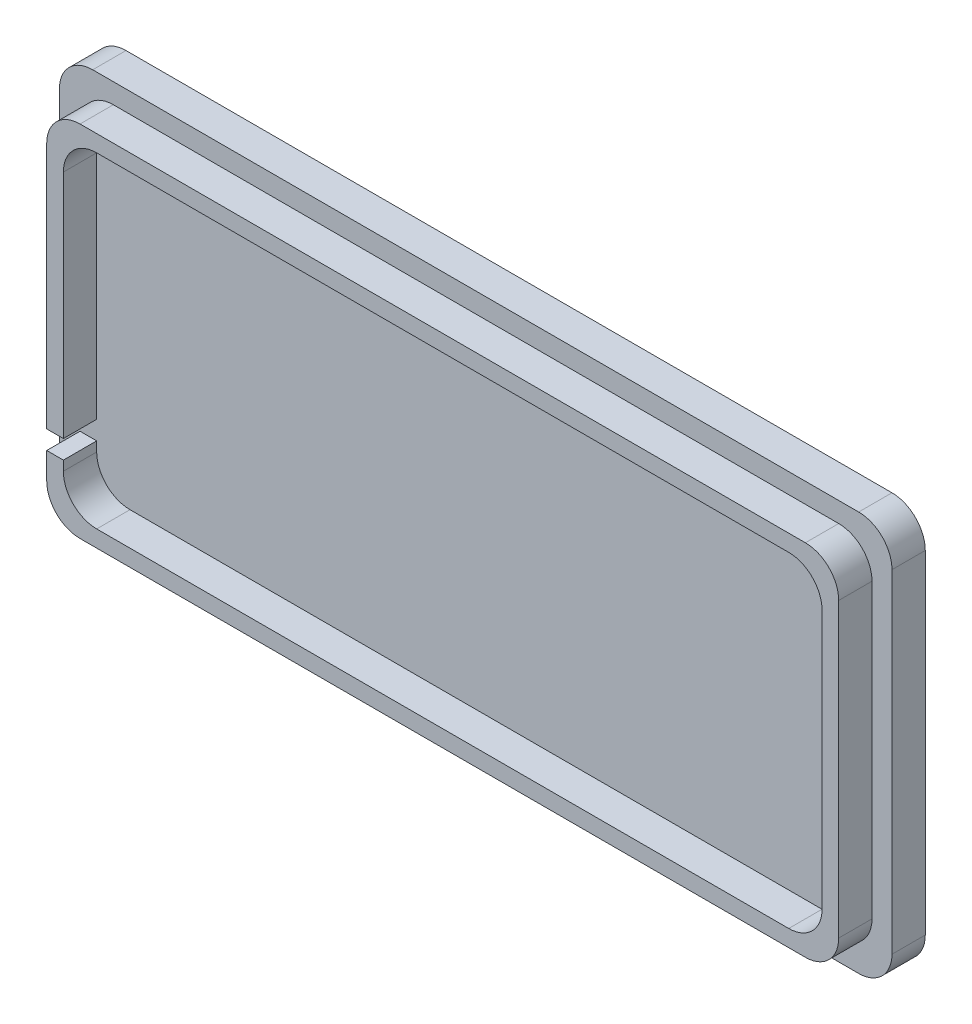
ISO-10303-21;
HEADER;
FILE_DESCRIPTION(('STEP AP214'),'2;1');
FILE_NAME('part.step','',(''),(''),'','','');
FILE_SCHEMA(('AUTOMOTIVE_DESIGN { 1 0 10303 214 1 1 1 1 }'));
ENDSEC;
DATA;
#1=APPLICATION_CONTEXT('core data for automotive mechanical design processes');
#2=APPLICATION_PROTOCOL_DEFINITION('international standard','automotive_design',2000,#1);
#3=PRODUCT_CONTEXT('',#1,'mechanical');
#4=PRODUCT('Part','Part','',(#3));
#5=PRODUCT_RELATED_PRODUCT_CATEGORY('part','',(#4));
#6=PRODUCT_DEFINITION_FORMATION('','',#4);
#7=PRODUCT_DEFINITION_CONTEXT('part definition',#1,'design');
#8=PRODUCT_DEFINITION('design','',#6,#7);
#9=PRODUCT_DEFINITION_SHAPE('','',#8);
#10=(LENGTH_UNIT() NAMED_UNIT(*) SI_UNIT(.MILLI.,.METRE.));
#11=(NAMED_UNIT(*) PLANE_ANGLE_UNIT() SI_UNIT($,.RADIAN.));
#12=(NAMED_UNIT(*) SI_UNIT($,.STERADIAN.) SOLID_ANGLE_UNIT());
#13=UNCERTAINTY_MEASURE_WITH_UNIT(LENGTH_MEASURE(1.E-05),#10,'distance_accuracy_value','');
#14=(GEOMETRIC_REPRESENTATION_CONTEXT(3) GLOBAL_UNCERTAINTY_ASSIGNED_CONTEXT((#13)) GLOBAL_UNIT_ASSIGNED_CONTEXT((#10,
#11,#12)) REPRESENTATION_CONTEXT('',''));
#15=CARTESIAN_POINT('',(0.,0.,0.));
#16=DIRECTION('',(0.,0.,1.));
#17=DIRECTION('',(1.,0.,0.));
#18=AXIS2_PLACEMENT_3D('',#15,#16,#17);
#19=CARTESIAN_POINT('',(-151.003,68.453,12.7));
#20=DIRECTION('',(1.,0.,0.));
#21=DIRECTION('',(0.,0.,-1.));
#22=AXIS2_PLACEMENT_3D('',#19,#20,#21);
#23=PLANE('',#22);
#24=DIRECTION('',(0.,-1.,0.));
#25=VECTOR('',#24,1.);
#26=CARTESIAN_POINT('',(-151.003,68.453,12.7));
#27=LINE('',#26,#25);
#28=CARTESIAN_POINT('',(-151.003,55.753,12.7));
#29=VERTEX_POINT('',#28);
#30=CARTESIAN_POINT('',(-151.003,-38.6080000000006,12.7));
#31=VERTEX_POINT('',#30);
#32=EDGE_CURVE('E247',#29,#31,#27,.T.);
#33=ORIENTED_EDGE('',*,*,#32,.F.);
#34=DIRECTION('',(0.,0.,-1.));
#35=VECTOR('',#34,1.);
#36=CARTESIAN_POINT('',(-151.003,55.753,12.7));
#37=LINE('',#36,#35);
#38=CARTESIAN_POINT('',(-151.003,55.753,0.));
#39=VERTEX_POINT('',#38);
#40=EDGE_CURVE('E358',#29,#39,#37,.T.);
#41=ORIENTED_EDGE('',*,*,#40,.T.);
#42=DIRECTION('',(0.,-1.,0.));
#43=VECTOR('',#42,1.);
#44=CARTESIAN_POINT('',(-151.003,68.453,0.));
#45=LINE('',#44,#43);
#46=CARTESIAN_POINT('',(-151.003,-38.6080000000006,0.));
#47=VERTEX_POINT('',#46);
#48=EDGE_CURVE('E314',#39,#47,#45,.T.);
#49=ORIENTED_EDGE('',*,*,#48,.T.);
#50=DIRECTION('',(0.,0.,-1.));
#51=VECTOR('',#50,1.);
#52=CARTESIAN_POINT('',(-151.003,-38.6080000000006,12.7));
#53=LINE('',#52,#51);
#54=EDGE_CURVE('E256',#31,#47,#53,.T.);
#55=ORIENTED_EDGE('',*,*,#54,.F.);
#56=EDGE_LOOP('',(#33,#41,#49,#55));
#57=FACE_BOUND('',#56,.T.);
#58=ADVANCED_FACE('F33',(#57),#23,.F.);
#59=CARTESIAN_POINT('',(-144.653,62.103,0.));
#60=DIRECTION('',(-1.,0.,0.));
#61=DIRECTION('',(0.,0.,1.));
#62=AXIS2_PLACEMENT_3D('',#59,#60,#61);
#63=PLANE('',#62);
#64=DIRECTION('',(0.,-1.,0.));
#65=VECTOR('',#64,1.);
#66=CARTESIAN_POINT('',(-144.653,62.103,0.));
#67=LINE('',#66,#65);
#68=CARTESIAN_POINT('',(-144.653,49.403,0.));
#69=VERTEX_POINT('',#68);
#70=CARTESIAN_POINT('',(-144.653,-38.6080000000006,0.));
#71=VERTEX_POINT('',#70);
#72=EDGE_CURVE('E267',#69,#71,#67,.T.);
#73=ORIENTED_EDGE('',*,*,#72,.F.);
#74=DIRECTION('',(0.,0.,1.));
#75=VECTOR('',#74,1.);
#76=CARTESIAN_POINT('',(-144.653,49.403,12.7));
#77=LINE('',#76,#75);
#78=CARTESIAN_POINT('',(-144.653,49.403,12.7));
#79=VERTEX_POINT('',#78);
#80=EDGE_CURVE('E226',#69,#79,#77,.T.);
#81=ORIENTED_EDGE('',*,*,#80,.T.);
#82=DIRECTION('',(0.,-1.,0.));
#83=VECTOR('',#82,1.);
#84=CARTESIAN_POINT('',(-144.653,62.103,12.7));
#85=LINE('',#84,#83);
#86=CARTESIAN_POINT('',(-144.653,-38.6080000000006,12.7));
#87=VERTEX_POINT('',#86);
#88=EDGE_CURVE('E220',#79,#87,#85,.T.);
#89=ORIENTED_EDGE('',*,*,#88,.T.);
#90=DIRECTION('',(0.,0.,1.));
#91=VECTOR('',#90,1.);
#92=CARTESIAN_POINT('',(-144.653,-38.6080000000006,12.7));
#93=LINE('',#92,#91);
#94=EDGE_CURVE('E224',#71,#87,#93,.T.);
#95=ORIENTED_EDGE('',*,*,#94,.F.);
#96=EDGE_LOOP('',(#73,#81,#89,#95));
#97=FACE_BOUND('',#96,.T.);
#98=ADVANCED_FACE('F223',(#97),#63,.F.);
#99=CARTESIAN_POINT('',(-151.003,-45.7200000000006,0.));
#100=VERTEX_POINT('',#99);
#101=CARTESIAN_POINT('',(-151.003,-55.753,0.));
#102=VERTEX_POINT('',#101);
#103=EDGE_CURVE('E293',#100,#102,#45,.T.);
#104=ORIENTED_EDGE('',*,*,#103,.T.);
#105=DIRECTION('',(0.,0.,-1.));
#106=VECTOR('',#105,1.);
#107=CARTESIAN_POINT('',(-151.003,-55.753,12.7));
#108=LINE('',#107,#106);
#109=CARTESIAN_POINT('',(-151.003,-55.753,12.7));
#110=VERTEX_POINT('',#109);
#111=EDGE_CURVE('E384',#102,#110,#108,.F.);
#112=ORIENTED_EDGE('',*,*,#111,.T.);
#113=CARTESIAN_POINT('',(-151.003,-45.7200000000006,12.7));
#114=VERTEX_POINT('',#113);
#115=EDGE_CURVE('E305',#114,#110,#27,.T.);
#116=ORIENTED_EDGE('',*,*,#115,.F.);
#117=DIRECTION('',(0.,0.,1.));
#118=VECTOR('',#117,1.);
#119=CARTESIAN_POINT('',(-151.003,-45.7200000000006,12.7));
#120=LINE('',#119,#118);
#121=EDGE_CURVE('E258',#100,#114,#120,.T.);
#122=ORIENTED_EDGE('',*,*,#121,.F.);
#123=EDGE_LOOP('',(#104,#112,#116,#122));
#124=FACE_BOUND('',#123,.T.);
#125=ADVANCED_FACE('F502',(#124),#23,.F.);
#126=CARTESIAN_POINT('',(-151.003,-68.453,12.7));
#127=DIRECTION('',(0.,1.,0.));
#128=DIRECTION('',(-1.,0.,0.));
#129=AXIS2_PLACEMENT_3D('',#126,#127,#128);
#130=PLANE('',#129);
#131=DIRECTION('',(1.,0.,0.));
#132=VECTOR('',#131,1.);
#133=CARTESIAN_POINT('',(-151.003,-68.453,0.));
#134=LINE('',#133,#132);
#135=CARTESIAN_POINT('',(-138.303,-68.453,0.));
#136=VERTEX_POINT('',#135);
#137=CARTESIAN_POINT('',(138.303,-68.453,0.));
#138=VERTEX_POINT('',#137);
#139=EDGE_CURVE('E316',#136,#138,#134,.T.);
#140=ORIENTED_EDGE('',*,*,#139,.T.);
#141=DIRECTION('',(0.,0.,-1.));
#142=VECTOR('',#141,1.);
#143=CARTESIAN_POINT('',(138.303,-68.453,12.7));
#144=LINE('',#143,#142);
#145=CARTESIAN_POINT('',(138.303,-68.453,12.7));
#146=VERTEX_POINT('',#145);
#147=EDGE_CURVE('E382',#138,#146,#144,.F.);
#148=ORIENTED_EDGE('',*,*,#147,.T.);
#149=DIRECTION('',(1.,0.,0.));
#150=VECTOR('',#149,1.);
#151=CARTESIAN_POINT('',(-151.003,-68.453,12.7));
#152=LINE('',#151,#150);
#153=CARTESIAN_POINT('',(-138.303,-68.453,12.7));
#154=VERTEX_POINT('',#153);
#155=EDGE_CURVE('E304',#154,#146,#152,.T.);
#156=ORIENTED_EDGE('',*,*,#155,.F.);
#157=DIRECTION('',(0.,0.,-1.));
#158=VECTOR('',#157,1.);
#159=CARTESIAN_POINT('',(-138.303,-68.453,12.7));
#160=LINE('',#159,#158);
#161=EDGE_CURVE('E379',#154,#136,#160,.T.);
#162=ORIENTED_EDGE('',*,*,#161,.T.);
#163=EDGE_LOOP('',(#140,#148,#156,#162));
#164=FACE_BOUND('',#163,.T.);
#165=ADVANCED_FACE('F432',(#164),#130,.F.);
#166=CARTESIAN_POINT('',(151.003,68.453,12.7));
#167=DIRECTION('',(-1.,0.,0.));
#168=DIRECTION('',(0.,0.,1.));
#169=AXIS2_PLACEMENT_3D('',#166,#167,#168);
#170=PLANE('',#169);
#171=DIRECTION('',(0.,1.,0.));
#172=VECTOR('',#171,1.);
#173=CARTESIAN_POINT('',(151.003,68.453,0.));
#174=LINE('',#173,#172);
#175=CARTESIAN_POINT('',(151.003,-55.753,0.));
#176=VERTEX_POINT('',#175);
#177=CARTESIAN_POINT('',(151.003,55.753,0.));
#178=VERTEX_POINT('',#177);
#179=EDGE_CURVE('E319',#176,#178,#174,.T.);
#180=ORIENTED_EDGE('',*,*,#179,.T.);
#181=DIRECTION('',(0.,0.,-1.));
#182=VECTOR('',#181,1.);
#183=CARTESIAN_POINT('',(151.003,55.753,12.7));
#184=LINE('',#183,#182);
#185=CARTESIAN_POINT('',(151.003,55.753,12.7));
#186=VERTEX_POINT('',#185);
#187=EDGE_CURVE('E377',#178,#186,#184,.F.);
#188=ORIENTED_EDGE('',*,*,#187,.T.);
#189=DIRECTION('',(0.,1.,0.));
#190=VECTOR('',#189,1.);
#191=CARTESIAN_POINT('',(151.003,68.453,12.7));
#192=LINE('',#191,#190);
#193=CARTESIAN_POINT('',(151.003,-55.753,12.7));
#194=VERTEX_POINT('',#193);
#195=EDGE_CURVE('E308',#194,#186,#192,.T.);
#196=ORIENTED_EDGE('',*,*,#195,.F.);
#197=DIRECTION('',(0.,0.,-1.));
#198=VECTOR('',#197,1.);
#199=CARTESIAN_POINT('',(151.003,-55.753,12.7));
#200=LINE('',#199,#198);
#201=EDGE_CURVE('E374',#194,#176,#200,.T.);
#202=ORIENTED_EDGE('',*,*,#201,.T.);
#203=EDGE_LOOP('',(#180,#188,#196,#202));
#204=FACE_BOUND('',#203,.T.);
#205=ADVANCED_FACE('F440',(#204),#170,.F.);
#206=CARTESIAN_POINT('',(-151.003,68.453,12.7));
#207=DIRECTION('',(0.,-1.,0.));
#208=DIRECTION('',(1.,0.,0.));
#209=AXIS2_PLACEMENT_3D('',#206,#207,#208);
#210=PLANE('',#209);
#211=DIRECTION('',(-1.,0.,0.));
#212=VECTOR('',#211,1.);
#213=CARTESIAN_POINT('',(-151.003,68.453,0.));
#214=LINE('',#213,#212);
#215=CARTESIAN_POINT('',(138.303,68.453,0.));
#216=VERTEX_POINT('',#215);
#217=CARTESIAN_POINT('',(-138.303,68.453,0.));
#218=VERTEX_POINT('',#217);
#219=EDGE_CURVE('E322',#216,#218,#214,.T.);
#220=ORIENTED_EDGE('',*,*,#219,.T.);
#221=DIRECTION('',(0.,0.,-1.));
#222=VECTOR('',#221,1.);
#223=CARTESIAN_POINT('',(-138.303,68.453,12.7));
#224=LINE('',#223,#222);
#225=CARTESIAN_POINT('',(-138.303,68.453,12.7));
#226=VERTEX_POINT('',#225);
#227=EDGE_CURVE('E364',#218,#226,#224,.F.);
#228=ORIENTED_EDGE('',*,*,#227,.T.);
#229=DIRECTION('',(-1.,0.,0.));
#230=VECTOR('',#229,1.);
#231=CARTESIAN_POINT('',(-151.003,68.453,12.7));
#232=LINE('',#231,#230);
#233=CARTESIAN_POINT('',(138.303,68.453,12.7));
#234=VERTEX_POINT('',#233);
#235=EDGE_CURVE('E311',#234,#226,#232,.T.);
#236=ORIENTED_EDGE('',*,*,#235,.F.);
#237=DIRECTION('',(0.,0.,-1.));
#238=VECTOR('',#237,1.);
#239=CARTESIAN_POINT('',(138.303,68.453,12.7));
#240=LINE('',#239,#238);
#241=EDGE_CURVE('E361',#234,#216,#240,.T.);
#242=ORIENTED_EDGE('',*,*,#241,.T.);
#243=EDGE_LOOP('',(#220,#228,#236,#242));
#244=FACE_BOUND('',#243,.T.);
#245=ADVANCED_FACE('F448',(#244),#210,.F.);
#246=CARTESIAN_POINT('',(0.,0.,12.7));
#247=DIRECTION('',(0.,0.,1.));
#248=DIRECTION('',(1.,0.,0.));
#249=AXIS2_PLACEMENT_3D('',#246,#247,#248);
#250=PLANE('',#249);
#251=ORIENTED_EDGE('',*,*,#235,.T.);
#252=CARTESIAN_POINT('',(-138.303,55.753,12.7));
#253=DIRECTION('',(0.,0.,1.));
#254=DIRECTION('',(1.,0.,0.));
#255=AXIS2_PLACEMENT_3D('',#252,#253,#254);
#256=CIRCLE('',#255,12.7);
#257=EDGE_CURVE('E372',#226,#29,#256,.T.);
#258=ORIENTED_EDGE('',*,*,#257,.T.);
#259=ORIENTED_EDGE('',*,*,#32,.T.);
#260=DIRECTION('',(1.,0.,0.));
#261=VECTOR('',#260,1.);
#262=CARTESIAN_POINT('',(158.624,-38.6080000000006,12.7));
#263=LINE('',#262,#261);
#264=EDGE_CURVE('E237',#31,#87,#263,.T.);
#265=ORIENTED_EDGE('',*,*,#264,.T.);
#266=ORIENTED_EDGE('',*,*,#88,.F.);
#267=CARTESIAN_POINT('',(-131.953,49.403,12.7));
#268=DIRECTION('',(0.,0.,1.));
#269=DIRECTION('',(1.,0.,0.));
#270=AXIS2_PLACEMENT_3D('',#267,#268,#269);
#271=CIRCLE('',#270,12.7);
#272=CARTESIAN_POINT('',(-131.953,62.103,12.7));
#273=VERTEX_POINT('',#272);
#274=EDGE_CURVE('E418',#79,#273,#271,.F.);
#275=ORIENTED_EDGE('',*,*,#274,.T.);
#276=DIRECTION('',(-1.,0.,0.));
#277=VECTOR('',#276,1.);
#278=CARTESIAN_POINT('',(144.653,62.103,12.7));
#279=LINE('',#278,#277);
#280=CARTESIAN_POINT('',(131.953,62.103,12.7));
#281=VERTEX_POINT('',#280);
#282=EDGE_CURVE('E241',#281,#273,#279,.T.);
#283=ORIENTED_EDGE('',*,*,#282,.F.);
#284=CARTESIAN_POINT('',(131.953,49.403,12.7));
#285=DIRECTION('',(0.,0.,1.));
#286=DIRECTION('',(1.,0.,0.));
#287=AXIS2_PLACEMENT_3D('',#284,#285,#286);
#288=CIRCLE('',#287,12.7);
#289=CARTESIAN_POINT('',(144.653,49.403,12.7));
#290=VERTEX_POINT('',#289);
#291=EDGE_CURVE('E412',#281,#290,#288,.F.);
#292=ORIENTED_EDGE('',*,*,#291,.T.);
#293=DIRECTION('',(0.,1.,0.));
#294=VECTOR('',#293,1.);
#295=CARTESIAN_POINT('',(144.653,-62.103,12.7));
#296=LINE('',#295,#294);
#297=CARTESIAN_POINT('',(144.653,-49.403,12.7));
#298=VERTEX_POINT('',#297);
#299=EDGE_CURVE('E266',#298,#290,#296,.T.);
#300=ORIENTED_EDGE('',*,*,#299,.F.);
#301=CARTESIAN_POINT('',(131.953,-49.403,12.7));
#302=DIRECTION('',(0.,0.,1.));
#303=DIRECTION('',(1.,0.,0.));
#304=AXIS2_PLACEMENT_3D('',#301,#302,#303);
#305=CIRCLE('',#304,12.7);
#306=CARTESIAN_POINT('',(131.953,-62.103,12.7));
#307=VERTEX_POINT('',#306);
#308=EDGE_CURVE('E414',#298,#307,#305,.F.);
#309=ORIENTED_EDGE('',*,*,#308,.T.);
#310=DIRECTION('',(1.,0.,0.));
#311=VECTOR('',#310,1.);
#312=CARTESIAN_POINT('',(-144.653,-62.103,12.7));
#313=LINE('',#312,#311);
#314=CARTESIAN_POINT('',(-131.953,-62.103,12.7));
#315=VERTEX_POINT('',#314);
#316=EDGE_CURVE('E229',#315,#307,#313,.T.);
#317=ORIENTED_EDGE('',*,*,#316,.F.);
#318=CARTESIAN_POINT('',(-131.953,-49.403,12.7));
#319=DIRECTION('',(0.,0.,1.));
#320=DIRECTION('',(1.,0.,0.));
#321=AXIS2_PLACEMENT_3D('',#318,#319,#320);
#322=CIRCLE('',#321,12.7);
#323=CARTESIAN_POINT('',(-144.653,-49.403,12.7));
#324=VERTEX_POINT('',#323);
#325=EDGE_CURVE('E416',#315,#324,#322,.F.);
#326=ORIENTED_EDGE('',*,*,#325,.T.);
#327=CARTESIAN_POINT('',(-144.653,-45.7200000000006,12.7));
#328=VERTEX_POINT('',#327);
#329=EDGE_CURVE('E230',#328,#324,#85,.T.);
#330=ORIENTED_EDGE('',*,*,#329,.F.);
#331=DIRECTION('',(-1.,0.,0.));
#332=VECTOR('',#331,1.);
#333=CARTESIAN_POINT('',(158.624,-45.7200000000006,12.7));
#334=LINE('',#333,#332);
#335=EDGE_CURVE('E248',#328,#114,#334,.T.);
#336=ORIENTED_EDGE('',*,*,#335,.T.);
#337=ORIENTED_EDGE('',*,*,#115,.T.);
#338=CARTESIAN_POINT('',(-138.303,-55.753,12.7));
#339=DIRECTION('',(0.,0.,1.));
#340=DIRECTION('',(1.,0.,0.));
#341=AXIS2_PLACEMENT_3D('',#338,#339,#340);
#342=CIRCLE('',#341,12.7);
#343=EDGE_CURVE('E366',#110,#154,#342,.T.);
#344=ORIENTED_EDGE('',*,*,#343,.T.);
#345=ORIENTED_EDGE('',*,*,#155,.T.);
#346=CARTESIAN_POINT('',(138.303,-55.753,12.7));
#347=DIRECTION('',(0.,0.,1.));
#348=DIRECTION('',(1.,0.,0.));
#349=AXIS2_PLACEMENT_3D('',#346,#347,#348);
#350=CIRCLE('',#349,12.7);
#351=EDGE_CURVE('E368',#146,#194,#350,.T.);
#352=ORIENTED_EDGE('',*,*,#351,.T.);
#353=ORIENTED_EDGE('',*,*,#195,.T.);
#354=CARTESIAN_POINT('',(138.303,55.753,12.7));
#355=DIRECTION('',(0.,0.,1.));
#356=DIRECTION('',(1.,0.,0.));
#357=AXIS2_PLACEMENT_3D('',#354,#355,#356);
#358=CIRCLE('',#357,12.7);
#359=EDGE_CURVE('E370',#186,#234,#358,.T.);
#360=ORIENTED_EDGE('',*,*,#359,.T.);
#361=EDGE_LOOP('',(#251,#258,#259,#265,#266,#275,#283,#292,#300,#309,#317,#326,#330,#336,#337,
#344,#345,#352,#353,#360));
#362=FACE_BOUND('',#361,.T.);
#363=ADVANCED_FACE('F245',(#362),#250,.T.);
#364=CARTESIAN_POINT('',(-158.877,-76.327,-12.7));
#365=DIRECTION('',(1.,0.,0.));
#366=DIRECTION('',(0.,0.,-1.));
#367=AXIS2_PLACEMENT_3D('',#364,#365,#366);
#368=PLANE('',#367);
#369=DIRECTION('',(0.,1.,0.));
#370=VECTOR('',#369,1.);
#371=CARTESIAN_POINT('',(-158.877,-76.327,-12.7));
#372=LINE('',#371,#370);
#373=CARTESIAN_POINT('',(-158.877,-63.627,-12.7));
#374=VERTEX_POINT('',#373);
#375=CARTESIAN_POINT('',(-158.877,63.373,-12.7));
#376=VERTEX_POINT('',#375);
#377=EDGE_CURVE('E282',#374,#376,#372,.T.);
#378=ORIENTED_EDGE('',*,*,#377,.F.);
#379=DIRECTION('',(0.,0.,1.));
#380=VECTOR('',#379,1.);
#381=CARTESIAN_POINT('',(-158.877,-63.627,-12.7));
#382=LINE('',#381,#380);
#383=CARTESIAN_POINT('',(-158.877,-63.627,0.));
#384=VERTEX_POINT('',#383);
#385=EDGE_CURVE('E388',#374,#384,#382,.T.);
#386=ORIENTED_EDGE('',*,*,#385,.T.);
#387=DIRECTION('',(0.,1.,0.));
#388=VECTOR('',#387,1.);
#389=CARTESIAN_POINT('',(-158.877,-76.327,0.));
#390=LINE('',#389,#388);
#391=CARTESIAN_POINT('',(-158.877,63.373,0.));
#392=VERTEX_POINT('',#391);
#393=EDGE_CURVE('E275',#384,#392,#390,.T.);
#394=ORIENTED_EDGE('',*,*,#393,.T.);
#395=DIRECTION('',(0.,0.,1.));
#396=VECTOR('',#395,1.);
#397=CARTESIAN_POINT('',(-158.877,63.373,-12.7));
#398=LINE('',#397,#396);
#399=EDGE_CURVE('E386',#392,#376,#398,.F.);
#400=ORIENTED_EDGE('',*,*,#399,.T.);
#401=EDGE_LOOP('',(#378,#386,#394,#400));
#402=FACE_BOUND('',#401,.T.);
#403=ADVANCED_FACE('F539',(#402),#368,.F.);
#404=CARTESIAN_POINT('',(-158.877,76.073,-12.7));
#405=DIRECTION('',(0.,-1.,0.));
#406=DIRECTION('',(0.,0.,-1.));
#407=AXIS2_PLACEMENT_3D('',#404,#405,#406);
#408=PLANE('',#407);
#409=DIRECTION('',(1.,0.,0.));
#410=VECTOR('',#409,1.);
#411=CARTESIAN_POINT('',(-158.877,76.073,0.));
#412=LINE('',#411,#410);
#413=CARTESIAN_POINT('',(-146.177,76.073,0.));
#414=VERTEX_POINT('',#413);
#415=CARTESIAN_POINT('',(145.923,76.073,0.));
#416=VERTEX_POINT('',#415);
#417=EDGE_CURVE('E296',#414,#416,#412,.T.);
#418=ORIENTED_EDGE('',*,*,#417,.T.);
#419=DIRECTION('',(0.,0.,1.));
#420=VECTOR('',#419,1.);
#421=CARTESIAN_POINT('',(145.923,76.073,-12.7));
#422=LINE('',#421,#420);
#423=CARTESIAN_POINT('',(145.923,76.073,-12.7));
#424=VERTEX_POINT('',#423);
#425=EDGE_CURVE('E410',#416,#424,#422,.F.);
#426=ORIENTED_EDGE('',*,*,#425,.T.);
#427=DIRECTION('',(1.,0.,0.));
#428=VECTOR('',#427,1.);
#429=CARTESIAN_POINT('',(-158.877,76.073,-12.7));
#430=LINE('',#429,#428);
#431=CARTESIAN_POINT('',(-146.177,76.073,-12.7));
#432=VERTEX_POINT('',#431);
#433=EDGE_CURVE('E285',#432,#424,#430,.T.);
#434=ORIENTED_EDGE('',*,*,#433,.F.);
#435=DIRECTION('',(0.,0.,1.));
#436=VECTOR('',#435,1.);
#437=CARTESIAN_POINT('',(-146.177,76.073,-12.7));
#438=LINE('',#437,#436);
#439=EDGE_CURVE('E407',#432,#414,#438,.T.);
#440=ORIENTED_EDGE('',*,*,#439,.T.);
#441=EDGE_LOOP('',(#418,#426,#434,#440));
#442=FACE_BOUND('',#441,.T.);
#443=ADVANCED_FACE('F542',(#442),#408,.F.);
#444=CARTESIAN_POINT('',(158.623,-76.327,-12.7));
#445=DIRECTION('',(-1.,0.,0.));
#446=DIRECTION('',(0.,0.,1.));
#447=AXIS2_PLACEMENT_3D('',#444,#445,#446);
#448=PLANE('',#447);
#449=DIRECTION('',(0.,-1.,0.));
#450=VECTOR('',#449,1.);
#451=CARTESIAN_POINT('',(158.623,-76.327,0.));
#452=LINE('',#451,#450);
#453=CARTESIAN_POINT('',(158.623,63.373,0.));
#454=VERTEX_POINT('',#453);
#455=CARTESIAN_POINT('',(158.623,-63.627,0.));
#456=VERTEX_POINT('',#455);
#457=EDGE_CURVE('E299',#454,#456,#452,.T.);
#458=ORIENTED_EDGE('',*,*,#457,.T.);
#459=DIRECTION('',(0.,0.,1.));
#460=VECTOR('',#459,1.);
#461=CARTESIAN_POINT('',(158.623,-63.627,-12.7));
#462=LINE('',#461,#460);
#463=CARTESIAN_POINT('',(158.623,-63.627,-12.7));
#464=VERTEX_POINT('',#463);
#465=EDGE_CURVE('E48',#456,#464,#462,.F.);
#466=ORIENTED_EDGE('',*,*,#465,.T.);
#467=DIRECTION('',(0.,-1.,0.));
#468=VECTOR('',#467,1.);
#469=CARTESIAN_POINT('',(158.623,-76.327,-12.7));
#470=LINE('',#469,#468);
#471=CARTESIAN_POINT('',(158.623,63.373,-12.7));
#472=VERTEX_POINT('',#471);
#473=EDGE_CURVE('E288',#472,#464,#470,.T.);
#474=ORIENTED_EDGE('',*,*,#473,.F.);
#475=DIRECTION('',(0.,0.,1.));
#476=VECTOR('',#475,1.);
#477=CARTESIAN_POINT('',(158.623,63.373,-12.7));
#478=LINE('',#477,#476);
#479=EDGE_CURVE('E403',#472,#454,#478,.T.);
#480=ORIENTED_EDGE('',*,*,#479,.T.);
#481=EDGE_LOOP('',(#458,#466,#474,#480));
#482=FACE_BOUND('',#481,.T.);
#483=ADVANCED_FACE('F546',(#482),#448,.F.);
#484=CARTESIAN_POINT('',(-158.877,-76.327,-12.7));
#485=DIRECTION('',(0.,1.,0.));
#486=DIRECTION('',(0.,0.,1.));
#487=AXIS2_PLACEMENT_3D('',#484,#485,#486);
#488=PLANE('',#487);
#489=DIRECTION('',(-1.,0.,0.));
#490=VECTOR('',#489,1.);
#491=CARTESIAN_POINT('',(-158.877,-76.327,0.));
#492=LINE('',#491,#490);
#493=CARTESIAN_POINT('',(145.923,-76.327,0.));
#494=VERTEX_POINT('',#493);
#495=CARTESIAN_POINT('',(-146.177,-76.327,0.));
#496=VERTEX_POINT('',#495);
#497=EDGE_CURVE('E286',#494,#496,#492,.T.);
#498=ORIENTED_EDGE('',*,*,#497,.T.);
#499=DIRECTION('',(0.,0.,1.));
#500=VECTOR('',#499,1.);
#501=CARTESIAN_POINT('',(-146.177,-76.327,-12.7));
#502=LINE('',#501,#500);
#503=CARTESIAN_POINT('',(-146.177,-76.327,-12.7));
#504=VERTEX_POINT('',#503);
#505=EDGE_CURVE('E394',#496,#504,#502,.F.);
#506=ORIENTED_EDGE('',*,*,#505,.T.);
#507=DIRECTION('',(-1.,0.,0.));
#508=VECTOR('',#507,1.);
#509=CARTESIAN_POINT('',(-158.877,-76.327,-12.7));
#510=LINE('',#509,#508);
#511=CARTESIAN_POINT('',(145.923,-76.327,-12.7));
#512=VERTEX_POINT('',#511);
#513=EDGE_CURVE('E290',#512,#504,#510,.T.);
#514=ORIENTED_EDGE('',*,*,#513,.F.);
#515=DIRECTION('',(0.,0.,1.));
#516=VECTOR('',#515,1.);
#517=CARTESIAN_POINT('',(145.923,-76.327,-12.7));
#518=LINE('',#517,#516);
#519=EDGE_CURVE('E391',#512,#494,#518,.T.);
#520=ORIENTED_EDGE('',*,*,#519,.T.);
#521=EDGE_LOOP('',(#498,#506,#514,#520));
#522=FACE_BOUND('',#521,.T.);
#523=ADVANCED_FACE('F550',(#522),#488,.F.);
#524=CARTESIAN_POINT('',(0.,0.,-12.7));
#525=DIRECTION('',(0.,0.,-1.));
#526=DIRECTION('',(-1.,0.,0.));
#527=AXIS2_PLACEMENT_3D('',#524,#525,#526);
#528=PLANE('',#527);
#529=ORIENTED_EDGE('',*,*,#513,.T.);
#530=CARTESIAN_POINT('',(-146.177,-63.627,-12.7));
#531=DIRECTION('',(0.,0.,-1.));
#532=DIRECTION('',(-1.,0.,0.));
#533=AXIS2_PLACEMENT_3D('',#530,#531,#532);
#534=CIRCLE('',#533,12.7);
#535=EDGE_CURVE('E401',#504,#374,#534,.T.);
#536=ORIENTED_EDGE('',*,*,#535,.T.);
#537=ORIENTED_EDGE('',*,*,#377,.T.);
#538=CARTESIAN_POINT('',(-146.177,63.373,-12.7));
#539=DIRECTION('',(0.,0.,-1.));
#540=DIRECTION('',(-1.,0.,0.));
#541=AXIS2_PLACEMENT_3D('',#538,#539,#540);
#542=CIRCLE('',#541,12.7);
#543=EDGE_CURVE('E396',#376,#432,#542,.T.);
#544=ORIENTED_EDGE('',*,*,#543,.T.);
#545=ORIENTED_EDGE('',*,*,#433,.T.);
#546=CARTESIAN_POINT('',(145.923,63.373,-12.7));
#547=DIRECTION('',(0.,0.,-1.));
#548=DIRECTION('',(-1.,0.,0.));
#549=AXIS2_PLACEMENT_3D('',#546,#547,#548);
#550=CIRCLE('',#549,12.7);
#551=EDGE_CURVE('E55',#424,#472,#550,.T.);
#552=ORIENTED_EDGE('',*,*,#551,.T.);
#553=ORIENTED_EDGE('',*,*,#473,.T.);
#554=CARTESIAN_POINT('',(145.923,-63.627,-12.7));
#555=DIRECTION('',(0.,0.,-1.));
#556=DIRECTION('',(-1.,0.,0.));
#557=AXIS2_PLACEMENT_3D('',#554,#555,#556);
#558=CIRCLE('',#557,12.7);
#559=EDGE_CURVE('E399',#464,#512,#558,.T.);
#560=ORIENTED_EDGE('',*,*,#559,.T.);
#561=EDGE_LOOP('',(#529,#536,#537,#544,#545,#552,#553,#560));
#562=FACE_BOUND('',#561,.T.);
#563=ADVANCED_FACE('F553',(#562),#528,.T.);
#564=CARTESIAN_POINT('',(0.,0.,0.));
#565=DIRECTION('',(0.,0.,-1.));
#566=DIRECTION('',(-1.,0.,0.));
#567=AXIS2_PLACEMENT_3D('',#564,#565,#566);
#568=PLANE('',#567);
#569=DIRECTION('',(0.,1.,0.));
#570=VECTOR('',#569,1.);
#571=CARTESIAN_POINT('',(144.653,-62.103,0.));
#572=LINE('',#571,#570);
#573=CARTESIAN_POINT('',(144.653,-49.403,0.));
#574=VERTEX_POINT('',#573);
#575=CARTESIAN_POINT('',(144.653,49.403,0.));
#576=VERTEX_POINT('',#575);
#577=EDGE_CURVE('E272',#574,#576,#572,.T.);
#578=ORIENTED_EDGE('',*,*,#577,.T.);
#579=CARTESIAN_POINT('',(131.953,49.403,0.));
#580=DIRECTION('',(0.,0.,-1.));
#581=DIRECTION('',(-1.,0.,0.));
#582=AXIS2_PLACEMENT_3D('',#579,#580,#581);
#583=CIRCLE('',#582,12.7);
#584=CARTESIAN_POINT('',(131.953,62.103,0.));
#585=VERTEX_POINT('',#584);
#586=EDGE_CURVE('E348',#576,#585,#583,.F.);
#587=ORIENTED_EDGE('',*,*,#586,.T.);
#588=DIRECTION('',(-1.,0.,0.));
#589=VECTOR('',#588,1.);
#590=CARTESIAN_POINT('',(144.653,62.103,0.));
#591=LINE('',#590,#589);
#592=CARTESIAN_POINT('',(-131.953,62.103,0.));
#593=VERTEX_POINT('',#592);
#594=EDGE_CURVE('E262',#585,#593,#591,.T.);
#595=ORIENTED_EDGE('',*,*,#594,.T.);
#596=CARTESIAN_POINT('',(-131.953,49.403,0.));
#597=DIRECTION('',(0.,0.,-1.));
#598=DIRECTION('',(-1.,0.,0.));
#599=AXIS2_PLACEMENT_3D('',#596,#597,#598);
#600=CIRCLE('',#599,12.7);
#601=EDGE_CURVE('E342',#593,#69,#600,.F.);
#602=ORIENTED_EDGE('',*,*,#601,.T.);
#603=ORIENTED_EDGE('',*,*,#72,.T.);
#604=DIRECTION('',(-1.,0.,0.));
#605=VECTOR('',#604,1.);
#606=CARTESIAN_POINT('',(158.624,-38.6080000000006,0.));
#607=LINE('',#606,#605);
#608=EDGE_CURVE('E240',#71,#47,#607,.T.);
#609=ORIENTED_EDGE('',*,*,#608,.T.);
#610=ORIENTED_EDGE('',*,*,#48,.F.);
#611=CARTESIAN_POINT('',(-138.303,55.753,0.));
#612=DIRECTION('',(0.,0.,-1.));
#613=DIRECTION('',(-1.,0.,0.));
#614=AXIS2_PLACEMENT_3D('',#611,#612,#613);
#615=CIRCLE('',#614,12.7);
#616=EDGE_CURVE('E420',#39,#218,#615,.T.);
#617=ORIENTED_EDGE('',*,*,#616,.T.);
#618=ORIENTED_EDGE('',*,*,#219,.F.);
#619=CARTESIAN_POINT('',(138.303,55.753,0.));
#620=DIRECTION('',(0.,0.,-1.));
#621=DIRECTION('',(-1.,0.,0.));
#622=AXIS2_PLACEMENT_3D('',#619,#620,#621);
#623=CIRCLE('',#622,12.7);
#624=EDGE_CURVE('E422',#216,#178,#623,.T.);
#625=ORIENTED_EDGE('',*,*,#624,.T.);
#626=ORIENTED_EDGE('',*,*,#179,.F.);
#627=CARTESIAN_POINT('',(138.303,-55.753,0.));
#628=DIRECTION('',(0.,0.,-1.));
#629=DIRECTION('',(-1.,0.,0.));
#630=AXIS2_PLACEMENT_3D('',#627,#628,#629);
#631=CIRCLE('',#630,12.7);
#632=EDGE_CURVE('E41',#176,#138,#631,.T.);
#633=ORIENTED_EDGE('',*,*,#632,.T.);
#634=ORIENTED_EDGE('',*,*,#139,.F.);
#635=CARTESIAN_POINT('',(-138.303,-55.753,0.));
#636=DIRECTION('',(0.,0.,-1.));
#637=DIRECTION('',(-1.,0.,0.));
#638=AXIS2_PLACEMENT_3D('',#635,#636,#637);
#639=CIRCLE('',#638,12.7);
#640=EDGE_CURVE('E11',#136,#102,#639,.T.);
#641=ORIENTED_EDGE('',*,*,#640,.T.);
#642=ORIENTED_EDGE('',*,*,#103,.F.);
#643=DIRECTION('',(-1.,0.,0.));
#644=VECTOR('',#643,1.);
#645=CARTESIAN_POINT('',(158.624,-45.7200000000006,0.));
#646=LINE('',#645,#644);
#647=CARTESIAN_POINT('',(-144.653,-45.7200000000006,0.));
#648=VERTEX_POINT('',#647);
#649=EDGE_CURVE('E242',#648,#100,#646,.T.);
#650=ORIENTED_EDGE('',*,*,#649,.F.);
#651=CARTESIAN_POINT('',(-144.653,-49.403,0.));
#652=VERTEX_POINT('',#651);
#653=EDGE_CURVE('E265',#648,#652,#67,.T.);
#654=ORIENTED_EDGE('',*,*,#653,.T.);
#655=CARTESIAN_POINT('',(-131.953,-49.403,0.));
#656=DIRECTION('',(0.,0.,-1.));
#657=DIRECTION('',(-1.,0.,0.));
#658=AXIS2_PLACEMENT_3D('',#655,#656,#657);
#659=CIRCLE('',#658,12.7);
#660=CARTESIAN_POINT('',(-131.953,-62.103,0.));
#661=VERTEX_POINT('',#660);
#662=EDGE_CURVE('E344',#652,#661,#659,.F.);
#663=ORIENTED_EDGE('',*,*,#662,.T.);
#664=DIRECTION('',(1.,0.,0.));
#665=VECTOR('',#664,1.);
#666=CARTESIAN_POINT('',(-144.653,-62.103,0.));
#667=LINE('',#666,#665);
#668=CARTESIAN_POINT('',(131.953,-62.103,0.));
#669=VERTEX_POINT('',#668);
#670=EDGE_CURVE('E269',#661,#669,#667,.T.);
#671=ORIENTED_EDGE('',*,*,#670,.T.);
#672=CARTESIAN_POINT('',(131.953,-49.403,0.));
#673=DIRECTION('',(0.,0.,-1.));
#674=DIRECTION('',(-1.,0.,0.));
#675=AXIS2_PLACEMENT_3D('',#672,#673,#674);
#676=CIRCLE('',#675,12.7);
#677=EDGE_CURVE('E346',#669,#574,#676,.F.);
#678=ORIENTED_EDGE('',*,*,#677,.T.);
#679=EDGE_LOOP('',(#578,#587,#595,#602,#603,#609,#610,#617,#618,#625,#626,#633,#634,#641,#642,
#650,#654,#663,#671,#678));
#680=FACE_BOUND('',#679,.T.);
#681=ORIENTED_EDGE('',*,*,#393,.F.);
#682=CARTESIAN_POINT('',(-146.177,-63.627,0.));
#683=DIRECTION('',(0.,0.,-1.));
#684=DIRECTION('',(-1.,0.,0.));
#685=AXIS2_PLACEMENT_3D('',#682,#683,#684);
#686=CIRCLE('',#685,12.7);
#687=EDGE_CURVE('E340',#384,#496,#686,.F.);
#688=ORIENTED_EDGE('',*,*,#687,.T.);
#689=ORIENTED_EDGE('',*,*,#497,.F.);
#690=CARTESIAN_POINT('',(145.923,-63.627,0.));
#691=DIRECTION('',(0.,0.,-1.));
#692=DIRECTION('',(-1.,0.,0.));
#693=AXIS2_PLACEMENT_3D('',#690,#691,#692);
#694=CIRCLE('',#693,12.7);
#695=EDGE_CURVE('E338',#494,#456,#694,.F.);
#696=ORIENTED_EDGE('',*,*,#695,.T.);
#697=ORIENTED_EDGE('',*,*,#457,.F.);
#698=CARTESIAN_POINT('',(145.923,63.373,0.));
#699=DIRECTION('',(0.,0.,-1.));
#700=DIRECTION('',(-1.,0.,0.));
#701=AXIS2_PLACEMENT_3D('',#698,#699,#700);
#702=CIRCLE('',#701,12.7);
#703=EDGE_CURVE('E336',#454,#416,#702,.F.);
#704=ORIENTED_EDGE('',*,*,#703,.T.);
#705=ORIENTED_EDGE('',*,*,#417,.F.);
#706=CARTESIAN_POINT('',(-146.177,63.373,0.));
#707=DIRECTION('',(0.,0.,-1.));
#708=DIRECTION('',(-1.,0.,0.));
#709=AXIS2_PLACEMENT_3D('',#706,#707,#708);
#710=CIRCLE('',#709,12.7);
#711=EDGE_CURVE('E334',#414,#392,#710,.F.);
#712=ORIENTED_EDGE('',*,*,#711,.T.);
#713=EDGE_LOOP('',(#681,#688,#689,#696,#697,#704,#705,#712));
#714=FACE_BOUND('',#713,.T.);
#715=ADVANCED_FACE('F426',(#680,#714),#568,.F.);
#716=CARTESIAN_POINT('',(144.653,62.103,0.));
#717=DIRECTION('',(0.,1.,0.));
#718=DIRECTION('',(-1.,0.,0.));
#719=AXIS2_PLACEMENT_3D('',#716,#717,#718);
#720=PLANE('',#719);
#721=ORIENTED_EDGE('',*,*,#594,.F.);
#722=DIRECTION('',(0.,0.,1.));
#723=VECTOR('',#722,1.);
#724=CARTESIAN_POINT('',(131.953,62.103,12.7));
#725=LINE('',#724,#723);
#726=EDGE_CURVE('E326',#585,#281,#725,.T.);
#727=ORIENTED_EDGE('',*,*,#726,.T.);
#728=ORIENTED_EDGE('',*,*,#282,.T.);
#729=DIRECTION('',(0.,0.,1.));
#730=VECTOR('',#729,1.);
#731=CARTESIAN_POINT('',(-131.953,62.103,0.));
#732=LINE('',#731,#730);
#733=EDGE_CURVE('E313',#273,#593,#732,.F.);
#734=ORIENTED_EDGE('',*,*,#733,.T.);
#735=EDGE_LOOP('',(#721,#727,#728,#734));
#736=FACE_BOUND('',#735,.T.);
#737=ADVANCED_FACE('F463',(#736),#720,.F.);
#738=CARTESIAN_POINT('',(144.653,-62.103,0.));
#739=DIRECTION('',(1.,0.,0.));
#740=DIRECTION('',(0.,0.,-1.));
#741=AXIS2_PLACEMENT_3D('',#738,#739,#740);
#742=PLANE('',#741);
#743=ORIENTED_EDGE('',*,*,#299,.T.);
#744=DIRECTION('',(0.,0.,1.));
#745=VECTOR('',#744,1.);
#746=CARTESIAN_POINT('',(144.653,49.403,0.));
#747=LINE('',#746,#745);
#748=EDGE_CURVE('E332',#290,#576,#747,.F.);
#749=ORIENTED_EDGE('',*,*,#748,.T.);
#750=ORIENTED_EDGE('',*,*,#577,.F.);
#751=DIRECTION('',(0.,0.,1.));
#752=VECTOR('',#751,1.);
#753=CARTESIAN_POINT('',(144.653,-49.403,12.7));
#754=LINE('',#753,#752);
#755=EDGE_CURVE('E329',#574,#298,#754,.T.);
#756=ORIENTED_EDGE('',*,*,#755,.T.);
#757=EDGE_LOOP('',(#743,#749,#750,#756));
#758=FACE_BOUND('',#757,.T.);
#759=ADVANCED_FACE('F471',(#758),#742,.F.);
#760=CARTESIAN_POINT('',(-144.653,-62.103,0.));
#761=DIRECTION('',(0.,-1.,0.));
#762=DIRECTION('',(1.,0.,0.));
#763=AXIS2_PLACEMENT_3D('',#760,#761,#762);
#764=PLANE('',#763);
#765=ORIENTED_EDGE('',*,*,#316,.T.);
#766=DIRECTION('',(0.,0.,1.));
#767=VECTOR('',#766,1.);
#768=CARTESIAN_POINT('',(131.953,-62.103,0.));
#769=LINE('',#768,#767);
#770=EDGE_CURVE('E353',#307,#669,#769,.F.);
#771=ORIENTED_EDGE('',*,*,#770,.T.);
#772=ORIENTED_EDGE('',*,*,#670,.F.);
#773=DIRECTION('',(0.,0.,1.));
#774=VECTOR('',#773,1.);
#775=CARTESIAN_POINT('',(-131.953,-62.103,12.7));
#776=LINE('',#775,#774);
#777=EDGE_CURVE('E350',#661,#315,#776,.T.);
#778=ORIENTED_EDGE('',*,*,#777,.T.);
#779=EDGE_LOOP('',(#765,#771,#772,#778));
#780=FACE_BOUND('',#779,.T.);
#781=ADVANCED_FACE('F480',(#780),#764,.F.);
#782=ORIENTED_EDGE('',*,*,#329,.T.);
#783=DIRECTION('',(0.,0.,1.));
#784=VECTOR('',#783,1.);
#785=CARTESIAN_POINT('',(-144.653,-49.403,0.));
#786=LINE('',#785,#784);
#787=EDGE_CURVE('E355',#324,#652,#786,.F.);
#788=ORIENTED_EDGE('',*,*,#787,.T.);
#789=ORIENTED_EDGE('',*,*,#653,.F.);
#790=DIRECTION('',(0.,0.,-1.));
#791=VECTOR('',#790,1.);
#792=CARTESIAN_POINT('',(-144.653,-45.7200000000006,12.7));
#793=LINE('',#792,#791);
#794=EDGE_CURVE('E251',#328,#648,#793,.T.);
#795=ORIENTED_EDGE('',*,*,#794,.F.);
#796=EDGE_LOOP('',(#782,#788,#789,#795));
#797=FACE_BOUND('',#796,.T.);
#798=ADVANCED_FACE('F491',(#797),#63,.F.);
#799=CARTESIAN_POINT('',(158.624,-38.6080000000006,12.7));
#800=DIRECTION('',(0.,1.,0.));
#801=DIRECTION('',(0.,0.,1.));
#802=AXIS2_PLACEMENT_3D('',#799,#800,#801);
#803=PLANE('',#802);
#804=ORIENTED_EDGE('',*,*,#94,.T.);
#805=ORIENTED_EDGE('',*,*,#264,.F.);
#806=ORIENTED_EDGE('',*,*,#54,.T.);
#807=ORIENTED_EDGE('',*,*,#608,.F.);
#808=EDGE_LOOP('',(#804,#805,#806,#807));
#809=FACE_BOUND('',#808,.T.);
#810=ADVANCED_FACE('F235',(#809),#803,.F.);
#811=CARTESIAN_POINT('',(158.624,-45.7200000000006,12.7));
#812=DIRECTION('',(0.,-1.,0.));
#813=DIRECTION('',(0.,0.,-1.));
#814=AXIS2_PLACEMENT_3D('',#811,#812,#813);
#815=PLANE('',#814);
#816=ORIENTED_EDGE('',*,*,#794,.T.);
#817=ORIENTED_EDGE('',*,*,#649,.T.);
#818=ORIENTED_EDGE('',*,*,#121,.T.);
#819=ORIENTED_EDGE('',*,*,#335,.F.);
#820=EDGE_LOOP('',(#816,#817,#818,#819));
#821=FACE_BOUND('',#820,.T.);
#822=ADVANCED_FACE('F495',(#821),#815,.F.);
#823=CARTESIAN_POINT('',(131.953,49.403,0.));
#824=DIRECTION('',(0.,0.,-1.));
#825=DIRECTION('',(-1.,0.,0.));
#826=AXIS2_PLACEMENT_3D('',#823,#824,#825);
#827=CYLINDRICAL_SURFACE('',#826,12.7);
#828=ORIENTED_EDGE('',*,*,#586,.F.);
#829=ORIENTED_EDGE('',*,*,#748,.F.);
#830=ORIENTED_EDGE('',*,*,#291,.F.);
#831=ORIENTED_EDGE('',*,*,#726,.F.);
#832=EDGE_LOOP('',(#828,#829,#830,#831));
#833=FACE_BOUND('',#832,.T.);
#834=ADVANCED_FACE('F467',(#833),#827,.F.);
#835=CARTESIAN_POINT('',(131.953,-49.403,0.));
#836=DIRECTION('',(0.,0.,-1.));
#837=DIRECTION('',(-1.,0.,0.));
#838=AXIS2_PLACEMENT_3D('',#835,#836,#837);
#839=CYLINDRICAL_SURFACE('',#838,12.7);
#840=ORIENTED_EDGE('',*,*,#677,.F.);
#841=ORIENTED_EDGE('',*,*,#770,.F.);
#842=ORIENTED_EDGE('',*,*,#308,.F.);
#843=ORIENTED_EDGE('',*,*,#755,.F.);
#844=EDGE_LOOP('',(#840,#841,#842,#843));
#845=FACE_BOUND('',#844,.T.);
#846=ADVANCED_FACE('F476',(#845),#839,.F.);
#847=CARTESIAN_POINT('',(-131.953,-49.403,0.));
#848=DIRECTION('',(0.,0.,-1.));
#849=DIRECTION('',(-1.,0.,0.));
#850=AXIS2_PLACEMENT_3D('',#847,#848,#849);
#851=CYLINDRICAL_SURFACE('',#850,12.7);
#852=ORIENTED_EDGE('',*,*,#662,.F.);
#853=ORIENTED_EDGE('',*,*,#787,.F.);
#854=ORIENTED_EDGE('',*,*,#325,.F.);
#855=ORIENTED_EDGE('',*,*,#777,.F.);
#856=EDGE_LOOP('',(#852,#853,#854,#855));
#857=FACE_BOUND('',#856,.T.);
#858=ADVANCED_FACE('F485',(#857),#851,.F.);
#859=CARTESIAN_POINT('',(-131.953,49.403,0.));
#860=DIRECTION('',(0.,0.,-1.));
#861=DIRECTION('',(-1.,0.,0.));
#862=AXIS2_PLACEMENT_3D('',#859,#860,#861);
#863=CYLINDRICAL_SURFACE('',#862,12.7);
#864=ORIENTED_EDGE('',*,*,#601,.F.);
#865=ORIENTED_EDGE('',*,*,#733,.F.);
#866=ORIENTED_EDGE('',*,*,#274,.F.);
#867=ORIENTED_EDGE('',*,*,#80,.F.);
#868=EDGE_LOOP('',(#864,#865,#866,#867));
#869=FACE_BOUND('',#868,.T.);
#870=ADVANCED_FACE('F458',(#869),#863,.F.);
#871=CARTESIAN_POINT('',(-138.303,55.753,12.7));
#872=DIRECTION('',(0.,0.,-1.));
#873=DIRECTION('',(-1.,0.,0.));
#874=AXIS2_PLACEMENT_3D('',#871,#872,#873);
#875=CYLINDRICAL_SURFACE('',#874,12.7);
#876=ORIENTED_EDGE('',*,*,#257,.F.);
#877=ORIENTED_EDGE('',*,*,#227,.F.);
#878=ORIENTED_EDGE('',*,*,#616,.F.);
#879=ORIENTED_EDGE('',*,*,#40,.F.);
#880=EDGE_LOOP('',(#876,#877,#878,#879));
#881=FACE_BOUND('',#880,.T.);
#882=ADVANCED_FACE('F452',(#881),#875,.T.);
#883=CARTESIAN_POINT('',(138.303,55.753,12.7));
#884=DIRECTION('',(0.,0.,-1.));
#885=DIRECTION('',(-1.,0.,0.));
#886=AXIS2_PLACEMENT_3D('',#883,#884,#885);
#887=CYLINDRICAL_SURFACE('',#886,12.7);
#888=ORIENTED_EDGE('',*,*,#359,.F.);
#889=ORIENTED_EDGE('',*,*,#187,.F.);
#890=ORIENTED_EDGE('',*,*,#624,.F.);
#891=ORIENTED_EDGE('',*,*,#241,.F.);
#892=EDGE_LOOP('',(#888,#889,#890,#891));
#893=FACE_BOUND('',#892,.T.);
#894=ADVANCED_FACE('F443',(#893),#887,.T.);
#895=CARTESIAN_POINT('',(138.303,-55.753,12.7));
#896=DIRECTION('',(0.,0.,-1.));
#897=DIRECTION('',(-1.,0.,0.));
#898=AXIS2_PLACEMENT_3D('',#895,#896,#897);
#899=CYLINDRICAL_SURFACE('',#898,12.7);
#900=ORIENTED_EDGE('',*,*,#351,.F.);
#901=ORIENTED_EDGE('',*,*,#147,.F.);
#902=ORIENTED_EDGE('',*,*,#632,.F.);
#903=ORIENTED_EDGE('',*,*,#201,.F.);
#904=EDGE_LOOP('',(#900,#901,#902,#903));
#905=FACE_BOUND('',#904,.T.);
#906=ADVANCED_FACE('F436',(#905),#899,.T.);
#907=CARTESIAN_POINT('',(-138.303,-55.753,12.7));
#908=DIRECTION('',(0.,0.,-1.));
#909=DIRECTION('',(-1.,0.,0.));
#910=AXIS2_PLACEMENT_3D('',#907,#908,#909);
#911=CYLINDRICAL_SURFACE('',#910,12.7);
#912=ORIENTED_EDGE('',*,*,#343,.F.);
#913=ORIENTED_EDGE('',*,*,#111,.F.);
#914=ORIENTED_EDGE('',*,*,#640,.F.);
#915=ORIENTED_EDGE('',*,*,#161,.F.);
#916=EDGE_LOOP('',(#912,#913,#914,#915));
#917=FACE_BOUND('',#916,.T.);
#918=ADVANCED_FACE('F506',(#917),#911,.T.);
#919=CARTESIAN_POINT('',(-146.177,-63.627,-12.7));
#920=DIRECTION('',(0.,0.,1.));
#921=DIRECTION('',(1.,0.,0.));
#922=AXIS2_PLACEMENT_3D('',#919,#920,#921);
#923=CYLINDRICAL_SURFACE('',#922,12.7);
#924=ORIENTED_EDGE('',*,*,#535,.F.);
#925=ORIENTED_EDGE('',*,*,#505,.F.);
#926=ORIENTED_EDGE('',*,*,#687,.F.);
#927=ORIENTED_EDGE('',*,*,#385,.F.);
#928=EDGE_LOOP('',(#924,#925,#926,#927));
#929=FACE_BOUND('',#928,.T.);
#930=ADVANCED_FACE('F508',(#929),#923,.T.);
#931=CARTESIAN_POINT('',(145.923,-63.627,-12.7));
#932=DIRECTION('',(0.,0.,1.));
#933=DIRECTION('',(1.,0.,0.));
#934=AXIS2_PLACEMENT_3D('',#931,#932,#933);
#935=CYLINDRICAL_SURFACE('',#934,12.7);
#936=ORIENTED_EDGE('',*,*,#559,.F.);
#937=ORIENTED_EDGE('',*,*,#465,.F.);
#938=ORIENTED_EDGE('',*,*,#695,.F.);
#939=ORIENTED_EDGE('',*,*,#519,.F.);
#940=EDGE_LOOP('',(#936,#937,#938,#939));
#941=FACE_BOUND('',#940,.T.);
#942=ADVANCED_FACE('F514',(#941),#935,.T.);
#943=CARTESIAN_POINT('',(145.923,63.373,-12.7));
#944=DIRECTION('',(0.,0.,1.));
#945=DIRECTION('',(1.,0.,0.));
#946=AXIS2_PLACEMENT_3D('',#943,#944,#945);
#947=CYLINDRICAL_SURFACE('',#946,12.7);
#948=ORIENTED_EDGE('',*,*,#551,.F.);
#949=ORIENTED_EDGE('',*,*,#425,.F.);
#950=ORIENTED_EDGE('',*,*,#703,.F.);
#951=ORIENTED_EDGE('',*,*,#479,.F.);
#952=EDGE_LOOP('',(#948,#949,#950,#951));
#953=FACE_BOUND('',#952,.T.);
#954=ADVANCED_FACE('F611',(#953),#947,.T.);
#955=CARTESIAN_POINT('',(-146.177,63.373,-12.7));
#956=DIRECTION('',(0.,0.,1.));
#957=DIRECTION('',(1.,0.,0.));
#958=AXIS2_PLACEMENT_3D('',#955,#956,#957);
#959=CYLINDRICAL_SURFACE('',#958,12.7);
#960=ORIENTED_EDGE('',*,*,#543,.F.);
#961=ORIENTED_EDGE('',*,*,#399,.F.);
#962=ORIENTED_EDGE('',*,*,#711,.F.);
#963=ORIENTED_EDGE('',*,*,#439,.F.);
#964=EDGE_LOOP('',(#960,#961,#962,#963));
#965=FACE_BOUND('',#964,.T.);
#966=ADVANCED_FACE('F35',(#965),#959,.T.);
#967=CLOSED_SHELL('',(#58,#98,#125,#165,#205,#245,#363,#403,#443,#483,#523,#563,#715,#737,#759,
#781,#798,#810,#822,#834,#846,#858,#870,#882,#894,#906,#918,#930,#942,#954,#966));
#968=MANIFOLD_SOLID_BREP('B2',#967);
#969=ADVANCED_BREP_SHAPE_REPRESENTATION('',(#18,#968),#14);
#970=SHAPE_DEFINITION_REPRESENTATION(#9,#969);
ENDSEC;
END-ISO-10303-21;
